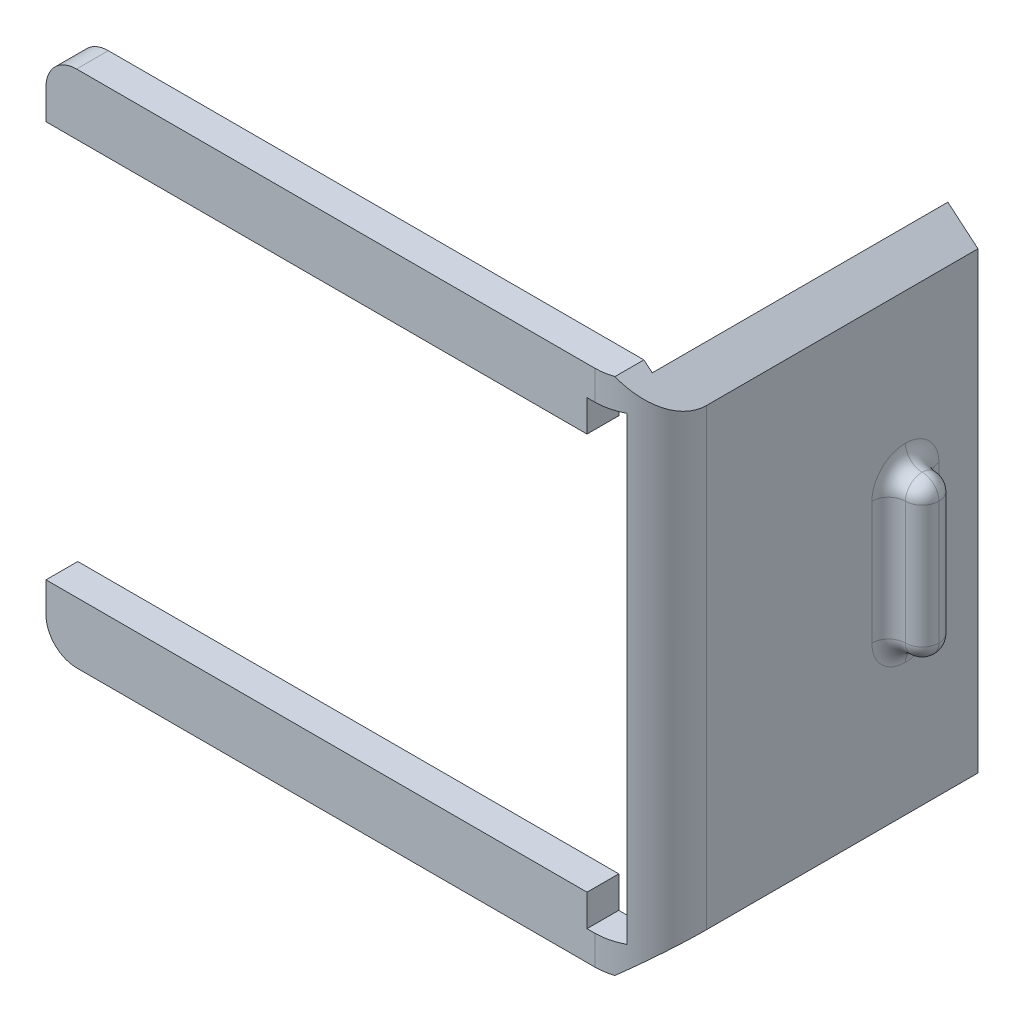
ISO-10303-21;
HEADER;
FILE_DESCRIPTION(('STEP AP214'),'2;1');
FILE_NAME('part.step','',(''),(''),'','','');
FILE_SCHEMA(('AUTOMOTIVE_DESIGN { 1 0 10303 214 1 1 1 1 }'));
ENDSEC;
DATA;
#1=APPLICATION_CONTEXT('core data for automotive mechanical design processes');
#2=APPLICATION_PROTOCOL_DEFINITION('international standard','automotive_design',2000,#1);
#3=PRODUCT_CONTEXT('',#1,'mechanical');
#4=PRODUCT('Part','Part','',(#3));
#5=PRODUCT_RELATED_PRODUCT_CATEGORY('part','',(#4));
#6=PRODUCT_DEFINITION_FORMATION('','',#4);
#7=PRODUCT_DEFINITION_CONTEXT('part definition',#1,'design');
#8=PRODUCT_DEFINITION('design','',#6,#7);
#9=PRODUCT_DEFINITION_SHAPE('','',#8);
#10=(LENGTH_UNIT() NAMED_UNIT(*) SI_UNIT(.MILLI.,.METRE.));
#11=(NAMED_UNIT(*) PLANE_ANGLE_UNIT() SI_UNIT($,.RADIAN.));
#12=(NAMED_UNIT(*) SI_UNIT($,.STERADIAN.) SOLID_ANGLE_UNIT());
#13=UNCERTAINTY_MEASURE_WITH_UNIT(LENGTH_MEASURE(1.E-05),#10,'distance_accuracy_value','');
#14=(GEOMETRIC_REPRESENTATION_CONTEXT(3) GLOBAL_UNCERTAINTY_ASSIGNED_CONTEXT((#13)) GLOBAL_UNIT_ASSIGNED_CONTEXT((#10,
#11,#12)) REPRESENTATION_CONTEXT('',''));
#15=CARTESIAN_POINT('',(0.,0.,0.));
#16=DIRECTION('',(0.,0.,1.));
#17=DIRECTION('',(1.,0.,0.));
#18=AXIS2_PLACEMENT_3D('',#15,#16,#17);
#19=CARTESIAN_POINT('',(36.6489794855664,19.0814859250043,29.3184));
#20=DIRECTION('',(-1.,0.,0.));
#21=DIRECTION('',(0.,-1.,0.));
#22=AXIS2_PLACEMENT_3D('',#19,#20,#21);
#23=PLANE('',#22);
#24=DIRECTION('',(0.,0.,-1.));
#25=VECTOR('',#24,1.);
#26=CARTESIAN_POINT('',(36.6489794855664,19.0814859250043,29.3184));
#27=LINE('',#26,#25);
#28=CARTESIAN_POINT('',(36.6489794855664,19.0814859250043,24.3184));
#29=VERTEX_POINT('',#28);
#30=CARTESIAN_POINT('',(36.6489794855664,19.0814859250043,0.));
#31=VERTEX_POINT('',#30);
#32=EDGE_CURVE('E226',#29,#31,#27,.T.);
#33=ORIENTED_EDGE('',*,*,#32,.F.);
#34=DIRECTION('',(0.,1.,0.));
#35=VECTOR('',#34,1.);
#36=CARTESIAN_POINT('',(36.6489794855664,-21.5814859250042,24.3184));
#37=LINE('',#36,#35);
#38=CARTESIAN_POINT('',(36.6489794855664,-21.5814859250042,24.3184));
#39=VERTEX_POINT('',#38);
#40=EDGE_CURVE('E202',#29,#39,#37,.F.);
#41=ORIENTED_EDGE('',*,*,#40,.T.);
#42=DIRECTION('',(0.,0.,-1.));
#43=VECTOR('',#42,1.);
#44=CARTESIAN_POINT('',(36.6489794855664,-21.5814859250042,29.3184));
#45=LINE('',#44,#43);
#46=CARTESIAN_POINT('',(36.6489794855664,-21.5814859250042,0.));
#47=VERTEX_POINT('',#46);
#48=EDGE_CURVE('E235',#39,#47,#45,.T.);
#49=ORIENTED_EDGE('',*,*,#48,.T.);
#50=DIRECTION('',(0.,1.,0.));
#51=VECTOR('',#50,1.);
#52=CARTESIAN_POINT('',(36.6489794855664,19.0814859250043,0.));
#53=LINE('',#52,#51);
#54=EDGE_CURVE('E247',#47,#31,#53,.T.);
#55=ORIENTED_EDGE('',*,*,#54,.T.);
#56=EDGE_LOOP('',(#33,#41,#49,#55));
#57=FACE_BOUND('',#56,.T.);
#58=CARTESIAN_POINT('',(36.6489794855664,4.25000000000002,6.5));
#59=DIRECTION('',(-1.,0.,0.));
#60=DIRECTION('',(0.,-1.,0.));
#61=AXIS2_PLACEMENT_3D('',#58,#59,#60);
#62=CIRCLE('',#61,3.);
#63=CARTESIAN_POINT('',(36.6489794855664,7.25000000000002,6.5));
#64=VERTEX_POINT('',#63);
#65=CARTESIAN_POINT('',(36.6489794855664,4.25000000000002,9.5));
#66=VERTEX_POINT('',#65);
#67=EDGE_CURVE('E114',#64,#66,#62,.F.);
#68=ORIENTED_EDGE('',*,*,#67,.F.);
#69=CARTESIAN_POINT('',(36.6489794855664,4.25000000000002,6.5));
#70=DIRECTION('',(-1.,0.,0.));
#71=DIRECTION('',(0.,-1.,0.));
#72=AXIS2_PLACEMENT_3D('',#69,#70,#71);
#73=CIRCLE('',#72,3.);
#74=CARTESIAN_POINT('',(36.6489794855664,4.25000000000002,3.5));
#75=VERTEX_POINT('',#74);
#76=EDGE_CURVE('E116',#75,#64,#73,.F.);
#77=ORIENTED_EDGE('',*,*,#76,.F.);
#78=DIRECTION('',(0.,1.,0.));
#79=VECTOR('',#78,1.);
#80=CARTESIAN_POINT('',(36.6489794855664,-8.24999999999997,3.5));
#81=LINE('',#80,#79);
#82=CARTESIAN_POINT('',(36.6489794855664,-6.74999999999997,3.5));
#83=VERTEX_POINT('',#82);
#84=EDGE_CURVE('E167',#75,#83,#81,.F.);
#85=ORIENTED_EDGE('',*,*,#84,.T.);
#86=CARTESIAN_POINT('',(36.6489794855664,-6.74999999999998,6.5));
#87=DIRECTION('',(-1.,0.,0.));
#88=DIRECTION('',(0.,-1.,0.));
#89=AXIS2_PLACEMENT_3D('',#86,#87,#88);
#90=CIRCLE('',#89,3.);
#91=CARTESIAN_POINT('',(36.6489794855664,-9.74999999999997,6.5));
#92=VERTEX_POINT('',#91);
#93=EDGE_CURVE('E164',#92,#83,#90,.F.);
#94=ORIENTED_EDGE('',*,*,#93,.F.);
#95=CARTESIAN_POINT('',(36.6489794855664,-6.74999999999998,6.5));
#96=DIRECTION('',(-1.,0.,0.));
#97=DIRECTION('',(0.,-1.,0.));
#98=AXIS2_PLACEMENT_3D('',#95,#96,#97);
#99=CIRCLE('',#98,3.);
#100=CARTESIAN_POINT('',(36.6489794855664,-6.74999999999998,9.5));
#101=VERTEX_POINT('',#100);
#102=EDGE_CURVE('E161',#101,#92,#99,.F.);
#103=ORIENTED_EDGE('',*,*,#102,.F.);
#104=DIRECTION('',(0.,-1.,0.));
#105=VECTOR('',#104,1.);
#106=CARTESIAN_POINT('',(36.6489794855664,5.75000000000002,9.5));
#107=LINE('',#106,#105);
#108=EDGE_CURVE('E119',#101,#66,#107,.F.);
#109=ORIENTED_EDGE('',*,*,#108,.T.);
#110=EDGE_LOOP('',(#68,#77,#85,#94,#103,#109));
#111=FACE_BOUND('',#110,.T.);
#112=ADVANCED_FACE('F41',(#57,#111),#23,.F.);
#113=CARTESIAN_POINT('',(0.,0.,29.3184));
#114=DIRECTION('',(0.,0.,1.));
#115=DIRECTION('',(1.,0.,0.));
#116=AXIS2_PLACEMENT_3D('',#113,#114,#115);
#117=PLANE('',#116);
#118=DIRECTION('',(-1.,0.,0.));
#119=VECTOR('',#118,1.);
#120=CARTESIAN_POINT('',(33.2005045161091,-24.4751,29.3184));
#121=LINE('',#120,#119);
#122=CARTESIAN_POINT('',(31.6489794855664,-24.4751,29.3184));
#123=VERTEX_POINT('',#122);
#124=CARTESIAN_POINT('',(-14.764,-24.4751,29.3184));
#125=VERTEX_POINT('',#124);
#126=EDGE_CURVE('E331',#123,#125,#121,.T.);
#127=ORIENTED_EDGE('',*,*,#126,.F.);
#128=DIRECTION('',(0.,1.,0.));
#129=VECTOR('',#128,1.);
#130=CARTESIAN_POINT('',(31.6489794855664,19.0814859250043,29.3184));
#131=LINE('',#130,#129);
#132=CARTESIAN_POINT('',(31.6489794855664,-21.8461986158981,29.3184));
#133=VERTEX_POINT('',#132);
#134=EDGE_CURVE('E220',#123,#133,#131,.T.);
#135=ORIENTED_EDGE('',*,*,#134,.T.);
#136=DIRECTION('',(1.,0.,0.));
#137=VECTOR('',#136,1.);
#138=CARTESIAN_POINT('',(30.95,-21.8461986158981,29.3184));
#139=LINE('',#138,#137);
#140=CARTESIAN_POINT('',(30.95,-21.8461986158981,29.3184));
#141=VERTEX_POINT('',#140);
#142=EDGE_CURVE('E335',#141,#133,#139,.T.);
#143=ORIENTED_EDGE('',*,*,#142,.F.);
#144=DIRECTION('',(0.,-1.,0.));
#145=VECTOR('',#144,1.);
#146=CARTESIAN_POINT('',(30.95,-19.0141,29.3184));
#147=LINE('',#146,#145);
#148=CARTESIAN_POINT('',(30.95,-19.0141,29.3184));
#149=VERTEX_POINT('',#148);
#150=EDGE_CURVE('E314',#149,#141,#147,.T.);
#151=ORIENTED_EDGE('',*,*,#150,.F.);
#152=DIRECTION('',(1.,0.,0.));
#153=VECTOR('',#152,1.);
#154=CARTESIAN_POINT('',(-17.5037090572133,-19.0141,29.3184));
#155=LINE('',#154,#153);
#156=CARTESIAN_POINT('',(-17.5037090572133,-19.0141,29.3184));
#157=VERTEX_POINT('',#156);
#158=EDGE_CURVE('E319',#157,#149,#155,.T.);
#159=ORIENTED_EDGE('',*,*,#158,.F.);
#160=DIRECTION('',(0.,1.,0.));
#161=VECTOR('',#160,1.);
#162=CARTESIAN_POINT('',(-17.5037090572133,-21.7351,29.3184));
#163=LINE('',#162,#161);
#164=CARTESIAN_POINT('',(-17.5037090572133,-21.7351,29.3184));
#165=VERTEX_POINT('',#164);
#166=EDGE_CURVE('E323',#165,#157,#163,.T.);
#167=ORIENTED_EDGE('',*,*,#166,.F.);
#168=CARTESIAN_POINT('',(-14.764,-21.73539092734,29.3184));
#169=DIRECTION('',(0.,0.,-1.));
#170=DIRECTION('',(-1.,0.,0.));
#171=AXIS2_PLACEMENT_3D('',#168,#169,#170);
#172=CIRCLE('',#171,2.73970907265998);
#173=EDGE_CURVE('E327',#125,#165,#172,.T.);
#174=ORIENTED_EDGE('',*,*,#173,.F.);
#175=EDGE_LOOP('',(#127,#135,#143,#151,#159,#167,#174));
#176=FACE_BOUND('',#175,.T.);
#177=ADVANCED_FACE('F391',(#176),#117,.T.);
#178=CARTESIAN_POINT('',(33.95,21.3461986158981,29.3184));
#179=DIRECTION('',(1.,0.,0.));
#180=DIRECTION('',(0.,1.,0.));
#181=AXIS2_PLACEMENT_3D('',#178,#179,#180);
#182=PLANE('',#181);
#183=DIRECTION('',(0.,0.,1.));
#184=VECTOR('',#183,1.);
#185=CARTESIAN_POINT('',(33.95,-21.8461986158981,-25.2690970531488));
#186=LINE('',#185,#184);
#187=CARTESIAN_POINT('',(33.95,-21.8461986158981,26.4736));
#188=VERTEX_POINT('',#187);
#189=CARTESIAN_POINT('',(33.95,-21.8461986158981,28.7574657341557));
#190=VERTEX_POINT('',#189);
#191=EDGE_CURVE('E337',#188,#190,#186,.T.);
#192=ORIENTED_EDGE('',*,*,#191,.T.);
#193=DIRECTION('',(0.,-1.,0.));
#194=VECTOR('',#193,1.);
#195=CARTESIAN_POINT('',(33.95,-21.8461986158981,28.7574657341557));
#196=LINE('',#195,#194);
#197=CARTESIAN_POINT('',(33.95,19.3461986158981,28.7574657341557));
#198=VERTEX_POINT('',#197);
#199=EDGE_CURVE('E214',#190,#198,#196,.F.);
#200=ORIENTED_EDGE('',*,*,#199,.T.);
#201=DIRECTION('',(0.,0.,1.));
#202=VECTOR('',#201,1.);
#203=CARTESIAN_POINT('',(33.95,19.3461986158981,-25.2690970531488));
#204=LINE('',#203,#202);
#205=CARTESIAN_POINT('',(33.95,19.3461986158981,26.4736));
#206=VERTEX_POINT('',#205);
#207=EDGE_CURVE('E254',#206,#198,#204,.T.);
#208=ORIENTED_EDGE('',*,*,#207,.F.);
#209=DIRECTION('',(0.,1.,0.));
#210=VECTOR('',#209,1.);
#211=CARTESIAN_POINT('',(33.95,19.3461986158981,26.4736));
#212=LINE('',#211,#210);
#213=CARTESIAN_POINT('',(33.95,21.3461986158981,26.4736));
#214=VERTEX_POINT('',#213);
#215=EDGE_CURVE('E257',#206,#214,#212,.T.);
#216=ORIENTED_EDGE('',*,*,#215,.T.);
#217=DIRECTION('',(0.,0.,-1.));
#218=VECTOR('',#217,1.);
#219=CARTESIAN_POINT('',(33.95,21.3461986158981,29.3184));
#220=LINE('',#219,#218);
#221=CARTESIAN_POINT('',(33.95,21.3461986158981,0.));
#222=VERTEX_POINT('',#221);
#223=EDGE_CURVE('E229',#214,#222,#220,.T.);
#224=ORIENTED_EDGE('',*,*,#223,.T.);
#225=DIRECTION('',(0.,-1.,0.));
#226=VECTOR('',#225,1.);
#227=CARTESIAN_POINT('',(33.95,21.3461986158981,0.));
#228=LINE('',#227,#226);
#229=CARTESIAN_POINT('',(33.95,-23.8461986158981,0.));
#230=VERTEX_POINT('',#229);
#231=EDGE_CURVE('E241',#222,#230,#228,.T.);
#232=ORIENTED_EDGE('',*,*,#231,.T.);
#233=DIRECTION('',(0.,0.,-1.));
#234=VECTOR('',#233,1.);
#235=CARTESIAN_POINT('',(33.95,-23.8461986158981,29.3184));
#236=LINE('',#235,#234);
#237=CARTESIAN_POINT('',(33.95,-23.8461986158981,26.4736));
#238=VERTEX_POINT('',#237);
#239=EDGE_CURVE('E232',#238,#230,#236,.T.);
#240=ORIENTED_EDGE('',*,*,#239,.F.);
#241=DIRECTION('',(0.,-1.,0.));
#242=VECTOR('',#241,1.);
#243=CARTESIAN_POINT('',(33.95,-21.8461986158981,26.4736));
#244=LINE('',#243,#242);
#245=EDGE_CURVE('E350',#188,#238,#244,.T.);
#246=ORIENTED_EDGE('',*,*,#245,.F.);
#247=EDGE_LOOP('',(#192,#200,#208,#216,#224,#232,#240,#246));
#248=FACE_BOUND('',#247,.T.);
#249=ADVANCED_FACE('F511',(#248),#182,.F.);
#250=CARTESIAN_POINT('',(36.6489794855664,19.0814859250043,29.3184));
#251=DIRECTION('',(-0.642787609686545,-0.766044443118973,0.));
#252=DIRECTION('',(0.766044443118973,-0.642787609686545,0.));
#253=AXIS2_PLACEMENT_3D('',#250,#251,#252);
#254=PLANE('',#253);
#255=DIRECTION('',(0.,0.,1.));
#256=VECTOR('',#255,1.);
#257=CARTESIAN_POINT('',(33.2005045161091,21.9751000000001,-25.2690970531488));
#258=LINE('',#257,#256);
#259=CARTESIAN_POINT('',(33.2005045161091,21.9751000000001,26.4736));
#260=VERTEX_POINT('',#259);
#261=CARTESIAN_POINT('',(33.2005045161091,21.9751000000001,29.0715852561834));
#262=VERTEX_POINT('',#261);
#263=EDGE_CURVE('E259',#260,#262,#258,.T.);
#264=ORIENTED_EDGE('',*,*,#263,.T.);
#265=CARTESIAN_POINT('',(31.6489794855664,23.2769840808908,24.3184));
#266=DIRECTION('',(-0.642787609686545,-0.766044443118973,0.));
#267=DIRECTION('',(0.766044443118973,-0.642787609686545,0.));
#268=AXIS2_PLACEMENT_3D('',#265,#266,#267);
#269=ELLIPSE('',#268,6.52703644666143,5.);
#270=EDGE_CURVE('E205',#262,#29,#269,.F.);
#271=ORIENTED_EDGE('',*,*,#270,.T.);
#272=ORIENTED_EDGE('',*,*,#32,.T.);
#273=DIRECTION('',(-0.766044443118973,0.642787609686545,0.));
#274=VECTOR('',#273,1.);
#275=CARTESIAN_POINT('',(36.6489794855664,19.0814859250043,0.));
#276=LINE('',#275,#274);
#277=EDGE_CURVE('E244',#31,#222,#276,.T.);
#278=ORIENTED_EDGE('',*,*,#277,.T.);
#279=ORIENTED_EDGE('',*,*,#223,.F.);
#280=DIRECTION('',(-0.76604444311897,0.642787609686549,0.));
#281=VECTOR('',#280,1.);
#282=CARTESIAN_POINT('',(33.95,21.3461986158981,26.4736));
#283=LINE('',#282,#281);
#284=EDGE_CURVE('E263',#214,#260,#283,.T.);
#285=ORIENTED_EDGE('',*,*,#284,.T.);
#286=EDGE_LOOP('',(#264,#271,#272,#278,#279,#285));
#287=FACE_BOUND('',#286,.T.);
#288=ADVANCED_FACE('F506',(#287),#254,.F.);
#289=CARTESIAN_POINT('',(36.6489794855664,-21.5814859250042,29.3184));
#290=DIRECTION('',(-0.642787609686547,0.766044443118971,0.));
#291=DIRECTION('',(-0.766044443118971,-0.642787609686547,0.));
#292=AXIS2_PLACEMENT_3D('',#289,#290,#291);
#293=PLANE('',#292);
#294=ORIENTED_EDGE('',*,*,#48,.F.);
#295=CARTESIAN_POINT('',(31.6489794855664,-25.7769840808907,24.3184));
#296=DIRECTION('',(-0.642787609686547,0.766044443118971,0.));
#297=DIRECTION('',(-0.766044443118971,-0.642787609686547,0.));
#298=AXIS2_PLACEMENT_3D('',#295,#296,#297);
#299=ELLIPSE('',#298,6.52703644666145,5.);
#300=CARTESIAN_POINT('',(33.2005045161091,-24.4751,29.0715852561834));
#301=VERTEX_POINT('',#300);
#302=EDGE_CURVE('E197',#39,#301,#299,.F.);
#303=ORIENTED_EDGE('',*,*,#302,.T.);
#304=DIRECTION('',(0.,0.,1.));
#305=VECTOR('',#304,1.);
#306=CARTESIAN_POINT('',(33.2005045161091,-24.4751,-25.2690970531488));
#307=LINE('',#306,#305);
#308=CARTESIAN_POINT('',(33.2005045161091,-24.4751,26.4736));
#309=VERTEX_POINT('',#308);
#310=EDGE_CURVE('E334',#309,#301,#307,.T.);
#311=ORIENTED_EDGE('',*,*,#310,.F.);
#312=DIRECTION('',(-0.766044443118984,-0.642787609686532,0.));
#313=VECTOR('',#312,1.);
#314=CARTESIAN_POINT('',(33.95,-23.8461986158981,26.4736));
#315=LINE('',#314,#313);
#316=EDGE_CURVE('E347',#238,#309,#315,.T.);
#317=ORIENTED_EDGE('',*,*,#316,.F.);
#318=ORIENTED_EDGE('',*,*,#239,.T.);
#319=DIRECTION('',(0.766044443118971,0.642787609686547,0.));
#320=VECTOR('',#319,1.);
#321=CARTESIAN_POINT('',(36.6489794855664,-21.5814859250042,0.));
#322=LINE('',#321,#320);
#323=EDGE_CURVE('E238',#230,#47,#322,.T.);
#324=ORIENTED_EDGE('',*,*,#323,.T.);
#325=EDGE_LOOP('',(#294,#303,#311,#317,#318,#324));
#326=FACE_BOUND('',#325,.T.);
#327=ADVANCED_FACE('F421',(#326),#293,.F.);
#328=DIRECTION('',(1.,0.,0.));
#329=VECTOR('',#328,1.);
#330=CARTESIAN_POINT('',(30.95,19.3461986158981,29.3184));
#331=LINE('',#330,#329);
#332=CARTESIAN_POINT('',(30.95,19.3461986158981,29.3184));
#333=VERTEX_POINT('',#332);
#334=CARTESIAN_POINT('',(31.6489794855664,19.3461986158981,29.3184));
#335=VERTEX_POINT('',#334);
#336=EDGE_CURVE('E299',#333,#335,#331,.T.);
#337=ORIENTED_EDGE('',*,*,#336,.T.);
#338=DIRECTION('',(0.,1.,0.));
#339=VECTOR('',#338,1.);
#340=CARTESIAN_POINT('',(31.6489794855664,19.0814859250043,29.3184));
#341=LINE('',#340,#339);
#342=CARTESIAN_POINT('',(31.6489794855664,21.9751000000001,29.3184));
#343=VERTEX_POINT('',#342);
#344=EDGE_CURVE('E223',#335,#343,#341,.T.);
#345=ORIENTED_EDGE('',*,*,#344,.T.);
#346=DIRECTION('',(-1.,0.,0.));
#347=VECTOR('',#346,1.);
#348=CARTESIAN_POINT('',(33.2005045161091,21.9751000000001,29.3184));
#349=LINE('',#348,#347);
#350=CARTESIAN_POINT('',(-14.764,21.9751,29.3184));
#351=VERTEX_POINT('',#350);
#352=EDGE_CURVE('E303',#343,#351,#349,.T.);
#353=ORIENTED_EDGE('',*,*,#352,.T.);
#354=CARTESIAN_POINT('',(-14.764,19.2353909273401,29.3184));
#355=DIRECTION('',(0.,0.,1.));
#356=DIRECTION('',(1.,0.,0.));
#357=AXIS2_PLACEMENT_3D('',#354,#355,#356);
#358=CIRCLE('',#357,2.73970907265998);
#359=CARTESIAN_POINT('',(-17.5037090572133,19.2351,29.3184));
#360=VERTEX_POINT('',#359);
#361=EDGE_CURVE('E306',#351,#360,#358,.T.);
#362=ORIENTED_EDGE('',*,*,#361,.T.);
#363=DIRECTION('',(0.,-1.,0.));
#364=VECTOR('',#363,1.);
#365=CARTESIAN_POINT('',(-17.5037090572133,19.2351,29.3184));
#366=LINE('',#365,#364);
#367=CARTESIAN_POINT('',(-17.5037090572133,16.5141,29.3184));
#368=VERTEX_POINT('',#367);
#369=EDGE_CURVE('E309',#360,#368,#366,.T.);
#370=ORIENTED_EDGE('',*,*,#369,.T.);
#371=DIRECTION('',(1.,0.,0.));
#372=VECTOR('',#371,1.);
#373=CARTESIAN_POINT('',(-17.5037090572133,16.5141,29.3184));
#374=LINE('',#373,#372);
#375=CARTESIAN_POINT('',(30.95,16.5141,29.3184));
#376=VERTEX_POINT('',#375);
#377=EDGE_CURVE('E295',#368,#376,#374,.T.);
#378=ORIENTED_EDGE('',*,*,#377,.T.);
#379=DIRECTION('',(0.,1.,0.));
#380=VECTOR('',#379,1.);
#381=CARTESIAN_POINT('',(30.95,16.5141,29.3184));
#382=LINE('',#381,#380);
#383=EDGE_CURVE('E296',#376,#333,#382,.T.);
#384=ORIENTED_EDGE('',*,*,#383,.T.);
#385=EDGE_LOOP('',(#337,#345,#353,#362,#370,#378,#384));
#386=FACE_BOUND('',#385,.T.);
#387=ADVANCED_FACE('F497',(#386),#117,.T.);
#388=CARTESIAN_POINT('',(0.,0.,0.));
#389=DIRECTION('',(0.,0.,1.));
#390=DIRECTION('',(1.,0.,0.));
#391=AXIS2_PLACEMENT_3D('',#388,#389,#390);
#392=PLANE('',#391);
#393=ORIENTED_EDGE('',*,*,#54,.F.);
#394=ORIENTED_EDGE('',*,*,#323,.F.);
#395=ORIENTED_EDGE('',*,*,#231,.F.);
#396=ORIENTED_EDGE('',*,*,#277,.F.);
#397=EDGE_LOOP('',(#393,#394,#395,#396));
#398=FACE_BOUND('',#397,.T.);
#399=ADVANCED_FACE('F709',(#398),#392,.F.);
#400=CARTESIAN_POINT('',(8.22299999999999,-1.24999999999999,26.4736));
#401=DIRECTION('',(0.,0.,-1.));
#402=DIRECTION('',(1.,0.,0.));
#403=AXIS2_PLACEMENT_3D('',#400,#401,#402);
#404=PLANE('',#403);
#405=DIRECTION('',(0.,1.,0.));
#406=VECTOR('',#405,1.);
#407=CARTESIAN_POINT('',(30.95,16.5141,26.4736));
#408=LINE('',#407,#406);
#409=CARTESIAN_POINT('',(30.95,16.5141,26.4736));
#410=VERTEX_POINT('',#409);
#411=CARTESIAN_POINT('',(30.95,19.3461986158981,26.4736));
#412=VERTEX_POINT('',#411);
#413=EDGE_CURVE('E253',#410,#412,#408,.T.);
#414=ORIENTED_EDGE('',*,*,#413,.F.);
#415=DIRECTION('',(1.,0.,0.));
#416=VECTOR('',#415,1.);
#417=CARTESIAN_POINT('',(-17.5037090572133,16.5141,26.4736));
#418=LINE('',#417,#416);
#419=CARTESIAN_POINT('',(-17.5037090572133,16.5141,26.4736));
#420=VERTEX_POINT('',#419);
#421=EDGE_CURVE('E275',#420,#410,#418,.T.);
#422=ORIENTED_EDGE('',*,*,#421,.F.);
#423=DIRECTION('',(0.,-1.,0.));
#424=VECTOR('',#423,1.);
#425=CARTESIAN_POINT('',(-17.5037090572133,19.2351,26.4736));
#426=LINE('',#425,#424);
#427=CARTESIAN_POINT('',(-17.5037090572133,19.2351,26.4736));
#428=VERTEX_POINT('',#427);
#429=EDGE_CURVE('E271',#428,#420,#426,.T.);
#430=ORIENTED_EDGE('',*,*,#429,.F.);
#431=CARTESIAN_POINT('',(-14.764,19.2353909273401,26.4736));
#432=DIRECTION('',(0.,0.,-1.));
#433=DIRECTION('',(0.,1.,0.));
#434=AXIS2_PLACEMENT_3D('',#431,#432,#433);
#435=CIRCLE('',#434,2.73970907265998);
#436=CARTESIAN_POINT('',(-14.764,21.9751,26.4736));
#437=VERTEX_POINT('',#436);
#438=EDGE_CURVE('E267',#437,#428,#435,.F.);
#439=ORIENTED_EDGE('',*,*,#438,.F.);
#440=DIRECTION('',(-1.,0.,0.));
#441=VECTOR('',#440,1.);
#442=CARTESIAN_POINT('',(33.2005045161091,21.9751000000001,26.4736));
#443=LINE('',#442,#441);
#444=EDGE_CURVE('E262',#260,#437,#443,.T.);
#445=ORIENTED_EDGE('',*,*,#444,.F.);
#446=ORIENTED_EDGE('',*,*,#284,.F.);
#447=ORIENTED_EDGE('',*,*,#215,.F.);
#448=DIRECTION('',(1.,0.,0.));
#449=VECTOR('',#448,1.);
#450=CARTESIAN_POINT('',(30.95,19.3461986158981,26.4736));
#451=LINE('',#450,#449);
#452=EDGE_CURVE('E258',#412,#206,#451,.T.);
#453=ORIENTED_EDGE('',*,*,#452,.F.);
#454=EDGE_LOOP('',(#414,#422,#430,#439,#445,#446,#447,#453));
#455=FACE_BOUND('',#454,.T.);
#456=ADVANCED_FACE('F509',(#455),#404,.T.);
#457=CARTESIAN_POINT('',(30.95,19.3461986158981,-25.2690970531488));
#458=DIRECTION('',(0.,-1.,0.));
#459=DIRECTION('',(0.,0.,-1.));
#460=AXIS2_PLACEMENT_3D('',#457,#458,#459);
#461=PLANE('',#460);
#462=ORIENTED_EDGE('',*,*,#207,.T.);
#463=CARTESIAN_POINT('',(31.6489794855664,19.3461986158981,24.3184));
#464=DIRECTION('',(0.,-1.,0.));
#465=DIRECTION('',(0.,0.,-1.));
#466=AXIS2_PLACEMENT_3D('',#463,#464,#465);
#467=CIRCLE('',#466,5.);
#468=EDGE_CURVE('E211',#198,#335,#467,.T.);
#469=ORIENTED_EDGE('',*,*,#468,.T.);
#470=ORIENTED_EDGE('',*,*,#336,.F.);
#471=DIRECTION('',(0.,0.,1.));
#472=VECTOR('',#471,1.);
#473=CARTESIAN_POINT('',(30.95,19.3461986158981,-25.2690970531488));
#474=LINE('',#473,#472);
#475=EDGE_CURVE('E250',#412,#333,#474,.T.);
#476=ORIENTED_EDGE('',*,*,#475,.F.);
#477=ORIENTED_EDGE('',*,*,#452,.T.);
#478=EDGE_LOOP('',(#462,#469,#470,#476,#477));
#479=FACE_BOUND('',#478,.T.);
#480=ADVANCED_FACE('F492',(#479),#461,.T.);
#481=CARTESIAN_POINT('',(33.2005045161091,21.9751000000001,-25.2690970531488));
#482=DIRECTION('',(0.,1.,0.));
#483=DIRECTION('',(-1.,0.,0.));
#484=AXIS2_PLACEMENT_3D('',#481,#482,#483);
#485=PLANE('',#484);
#486=ORIENTED_EDGE('',*,*,#352,.F.);
#487=CARTESIAN_POINT('',(31.6489794855664,21.9751000000001,24.3184));
#488=DIRECTION('',(0.,1.,0.));
#489=DIRECTION('',(-1.,0.,0.));
#490=AXIS2_PLACEMENT_3D('',#487,#488,#489);
#491=CIRCLE('',#490,5.);
#492=EDGE_CURVE('E208',#343,#262,#491,.T.);
#493=ORIENTED_EDGE('',*,*,#492,.T.);
#494=ORIENTED_EDGE('',*,*,#263,.F.);
#495=ORIENTED_EDGE('',*,*,#444,.T.);
#496=DIRECTION('',(0.,0.,1.));
#497=VECTOR('',#496,1.);
#498=CARTESIAN_POINT('',(-14.764,21.9751,-25.2690970531488));
#499=LINE('',#498,#497);
#500=EDGE_CURVE('E264',#437,#351,#499,.T.);
#501=ORIENTED_EDGE('',*,*,#500,.T.);
#502=EDGE_LOOP('',(#486,#493,#494,#495,#501));
#503=FACE_BOUND('',#502,.T.);
#504=ADVANCED_FACE('F504',(#503),#485,.T.);
#505=CARTESIAN_POINT('',(-14.764,19.2353909273401,-25.2690970531488));
#506=DIRECTION('',(0.,0.,1.));
#507=DIRECTION('',(1.,0.,0.));
#508=AXIS2_PLACEMENT_3D('',#505,#506,#507);
#509=CYLINDRICAL_SURFACE('',#508,2.73970907265998);
#510=ORIENTED_EDGE('',*,*,#500,.F.);
#511=ORIENTED_EDGE('',*,*,#438,.T.);
#512=DIRECTION('',(0.,0.,1.));
#513=VECTOR('',#512,1.);
#514=CARTESIAN_POINT('',(-17.5037090572133,19.2351,-25.2690970531488));
#515=LINE('',#514,#513);
#516=EDGE_CURVE('E268',#428,#360,#515,.T.);
#517=ORIENTED_EDGE('',*,*,#516,.T.);
#518=ORIENTED_EDGE('',*,*,#361,.F.);
#519=EDGE_LOOP('',(#510,#511,#517,#518));
#520=FACE_BOUND('',#519,.T.);
#521=ADVANCED_FACE('F678',(#520),#509,.T.);
#522=CARTESIAN_POINT('',(-17.5037090572133,19.2351,-25.2690970531488));
#523=DIRECTION('',(-1.,0.,0.));
#524=DIRECTION('',(0.,0.,1.));
#525=AXIS2_PLACEMENT_3D('',#522,#523,#524);
#526=PLANE('',#525);
#527=ORIENTED_EDGE('',*,*,#516,.F.);
#528=ORIENTED_EDGE('',*,*,#429,.T.);
#529=DIRECTION('',(0.,0.,1.));
#530=VECTOR('',#529,1.);
#531=CARTESIAN_POINT('',(-17.5037090572133,16.5141,-25.2690970531488));
#532=LINE('',#531,#530);
#533=EDGE_CURVE('E272',#420,#368,#532,.T.);
#534=ORIENTED_EDGE('',*,*,#533,.T.);
#535=ORIENTED_EDGE('',*,*,#369,.F.);
#536=EDGE_LOOP('',(#527,#528,#534,#535));
#537=FACE_BOUND('',#536,.T.);
#538=ADVANCED_FACE('F669',(#537),#526,.T.);
#539=CARTESIAN_POINT('',(-17.5037090572133,16.5141,-25.2690970531488));
#540=DIRECTION('',(0.,-1.,0.));
#541=DIRECTION('',(1.,0.,0.));
#542=AXIS2_PLACEMENT_3D('',#539,#540,#541);
#543=PLANE('',#542);
#544=ORIENTED_EDGE('',*,*,#533,.F.);
#545=ORIENTED_EDGE('',*,*,#421,.T.);
#546=DIRECTION('',(0.,0.,1.));
#547=VECTOR('',#546,1.);
#548=CARTESIAN_POINT('',(30.95,16.5141,-25.2690970531488));
#549=LINE('',#548,#547);
#550=EDGE_CURVE('E276',#410,#376,#549,.T.);
#551=ORIENTED_EDGE('',*,*,#550,.T.);
#552=ORIENTED_EDGE('',*,*,#377,.F.);
#553=EDGE_LOOP('',(#544,#545,#551,#552));
#554=FACE_BOUND('',#553,.T.);
#555=ADVANCED_FACE('F660',(#554),#543,.T.);
#556=CARTESIAN_POINT('',(30.95,16.5141,-25.2690970531488));
#557=DIRECTION('',(1.,0.,0.));
#558=DIRECTION('',(0.,0.,-1.));
#559=AXIS2_PLACEMENT_3D('',#556,#557,#558);
#560=PLANE('',#559);
#561=ORIENTED_EDGE('',*,*,#550,.F.);
#562=ORIENTED_EDGE('',*,*,#413,.T.);
#563=ORIENTED_EDGE('',*,*,#475,.T.);
#564=ORIENTED_EDGE('',*,*,#383,.F.);
#565=EDGE_LOOP('',(#561,#562,#563,#564));
#566=FACE_BOUND('',#565,.T.);
#567=ADVANCED_FACE('F653',(#566),#560,.T.);
#568=CARTESIAN_POINT('',(30.95,-21.8461986158981,-25.2690970531488));
#569=DIRECTION('',(0.,-1.,0.));
#570=DIRECTION('',(0.,0.,-1.));
#571=AXIS2_PLACEMENT_3D('',#568,#569,#570);
#572=PLANE('',#571);
#573=ORIENTED_EDGE('',*,*,#142,.T.);
#574=CARTESIAN_POINT('',(31.6489794855664,-21.8461986158981,24.3184));
#575=DIRECTION('',(0.,-1.,0.));
#576=DIRECTION('',(0.,0.,-1.));
#577=AXIS2_PLACEMENT_3D('',#574,#575,#576);
#578=CIRCLE('',#577,5.);
#579=EDGE_CURVE('E217',#133,#190,#578,.F.);
#580=ORIENTED_EDGE('',*,*,#579,.T.);
#581=ORIENTED_EDGE('',*,*,#191,.F.);
#582=DIRECTION('',(1.,0.,0.));
#583=VECTOR('',#582,1.);
#584=CARTESIAN_POINT('',(30.95,-21.8461986158981,26.4736));
#585=LINE('',#584,#583);
#586=CARTESIAN_POINT('',(30.95,-21.8461986158981,26.4736));
#587=VERTEX_POINT('',#586);
#588=EDGE_CURVE('E353',#587,#188,#585,.T.);
#589=ORIENTED_EDGE('',*,*,#588,.F.);
#590=DIRECTION('',(0.,0.,1.));
#591=VECTOR('',#590,1.);
#592=CARTESIAN_POINT('',(30.95,-21.8461986158981,-25.2690970531488));
#593=LINE('',#592,#591);
#594=EDGE_CURVE('E300',#587,#141,#593,.T.);
#595=ORIENTED_EDGE('',*,*,#594,.T.);
#596=EDGE_LOOP('',(#573,#580,#581,#589,#595));
#597=FACE_BOUND('',#596,.T.);
#598=ADVANCED_FACE('F375',(#597),#572,.F.);
#599=CARTESIAN_POINT('',(33.2005045161091,-24.4751,-25.2690970531488));
#600=DIRECTION('',(0.,1.,0.));
#601=DIRECTION('',(0.,0.,1.));
#602=AXIS2_PLACEMENT_3D('',#599,#600,#601);
#603=PLANE('',#602);
#604=ORIENTED_EDGE('',*,*,#310,.T.);
#605=CARTESIAN_POINT('',(31.6489794855664,-24.4751,24.3184));
#606=DIRECTION('',(0.,1.,0.));
#607=DIRECTION('',(0.,0.,1.));
#608=AXIS2_PLACEMENT_3D('',#605,#606,#607);
#609=CIRCLE('',#608,5.);
#610=EDGE_CURVE('E193',#301,#123,#609,.F.);
#611=ORIENTED_EDGE('',*,*,#610,.T.);
#612=ORIENTED_EDGE('',*,*,#126,.T.);
#613=DIRECTION('',(0.,0.,1.));
#614=VECTOR('',#613,1.);
#615=CARTESIAN_POINT('',(-14.764,-24.4751,-25.2690970531488));
#616=LINE('',#615,#614);
#617=CARTESIAN_POINT('',(-14.764,-24.4751,26.4736));
#618=VERTEX_POINT('',#617);
#619=EDGE_CURVE('E330',#618,#125,#616,.T.);
#620=ORIENTED_EDGE('',*,*,#619,.F.);
#621=DIRECTION('',(-1.,0.,0.));
#622=VECTOR('',#621,1.);
#623=CARTESIAN_POINT('',(33.2005045161091,-24.4751,26.4736));
#624=LINE('',#623,#622);
#625=EDGE_CURVE('E344',#309,#618,#624,.T.);
#626=ORIENTED_EDGE('',*,*,#625,.F.);
#627=EDGE_LOOP('',(#604,#611,#612,#620,#626));
#628=FACE_BOUND('',#627,.T.);
#629=ADVANCED_FACE('F425',(#628),#603,.F.);
#630=CARTESIAN_POINT('',(-14.764,-21.73539092734,-25.2690970531488));
#631=DIRECTION('',(0.,0.,1.));
#632=DIRECTION('',(1.,0.,0.));
#633=AXIS2_PLACEMENT_3D('',#630,#631,#632);
#634=CYLINDRICAL_SURFACE('',#633,2.73970907265998);
#635=CARTESIAN_POINT('',(-14.764,-21.73539092734,26.4736));
#636=DIRECTION('',(0.,0.,-1.));
#637=DIRECTION('',(0.,1.,0.));
#638=AXIS2_PLACEMENT_3D('',#635,#636,#637);
#639=CIRCLE('',#638,2.73970907265998);
#640=CARTESIAN_POINT('',(-17.5037090572133,-21.7351,26.4736));
#641=VERTEX_POINT('',#640);
#642=EDGE_CURVE('E341',#618,#641,#639,.T.);
#643=ORIENTED_EDGE('',*,*,#642,.F.);
#644=ORIENTED_EDGE('',*,*,#619,.T.);
#645=ORIENTED_EDGE('',*,*,#173,.T.);
#646=DIRECTION('',(0.,0.,1.));
#647=VECTOR('',#646,1.);
#648=CARTESIAN_POINT('',(-17.5037090572133,-21.7351,-25.2690970531488));
#649=LINE('',#648,#647);
#650=EDGE_CURVE('E326',#641,#165,#649,.T.);
#651=ORIENTED_EDGE('',*,*,#650,.F.);
#652=EDGE_LOOP('',(#643,#644,#645,#651));
#653=FACE_BOUND('',#652,.T.);
#654=ADVANCED_FACE('F528',(#653),#634,.T.);
#655=CARTESIAN_POINT('',(-17.5037090572133,-21.7351,-25.2690970531488));
#656=DIRECTION('',(1.,0.,0.));
#657=DIRECTION('',(0.,0.,-1.));
#658=AXIS2_PLACEMENT_3D('',#655,#656,#657);
#659=PLANE('',#658);
#660=DIRECTION('',(0.,1.,0.));
#661=VECTOR('',#660,1.);
#662=CARTESIAN_POINT('',(-17.5037090572133,-21.7351,26.4736));
#663=LINE('',#662,#661);
#664=CARTESIAN_POINT('',(-17.5037090572133,-19.0141,26.4736));
#665=VERTEX_POINT('',#664);
#666=EDGE_CURVE('E155',#641,#665,#663,.T.);
#667=ORIENTED_EDGE('',*,*,#666,.F.);
#668=ORIENTED_EDGE('',*,*,#650,.T.);
#669=ORIENTED_EDGE('',*,*,#166,.T.);
#670=DIRECTION('',(0.,0.,1.));
#671=VECTOR('',#670,1.);
#672=CARTESIAN_POINT('',(-17.5037090572133,-19.0141,-25.2690970531488));
#673=LINE('',#672,#671);
#674=EDGE_CURVE('E322',#665,#157,#673,.T.);
#675=ORIENTED_EDGE('',*,*,#674,.F.);
#676=EDGE_LOOP('',(#667,#668,#669,#675));
#677=FACE_BOUND('',#676,.T.);
#678=ADVANCED_FACE('F526',(#677),#659,.F.);
#679=CARTESIAN_POINT('',(-17.5037090572133,-19.0141,-25.2690970531488));
#680=DIRECTION('',(0.,-1.,0.));
#681=DIRECTION('',(0.,0.,-1.));
#682=AXIS2_PLACEMENT_3D('',#679,#680,#681);
#683=PLANE('',#682);
#684=DIRECTION('',(1.,0.,0.));
#685=VECTOR('',#684,1.);
#686=CARTESIAN_POINT('',(-17.5037090572133,-19.0141,26.4736));
#687=LINE('',#686,#685);
#688=CARTESIAN_POINT('',(30.95,-19.0141,26.4736));
#689=VERTEX_POINT('',#688);
#690=EDGE_CURVE('E151',#665,#689,#687,.T.);
#691=ORIENTED_EDGE('',*,*,#690,.F.);
#692=ORIENTED_EDGE('',*,*,#674,.T.);
#693=ORIENTED_EDGE('',*,*,#158,.T.);
#694=DIRECTION('',(0.,0.,1.));
#695=VECTOR('',#694,1.);
#696=CARTESIAN_POINT('',(30.95,-19.0141,-25.2690970531488));
#697=LINE('',#696,#695);
#698=EDGE_CURVE('E317',#689,#149,#697,.T.);
#699=ORIENTED_EDGE('',*,*,#698,.F.);
#700=EDGE_LOOP('',(#691,#692,#693,#699));
#701=FACE_BOUND('',#700,.T.);
#702=ADVANCED_FACE('F523',(#701),#683,.F.);
#703=CARTESIAN_POINT('',(30.95,-19.0141,-25.2690970531488));
#704=DIRECTION('',(-1.,0.,0.));
#705=DIRECTION('',(0.,0.,1.));
#706=AXIS2_PLACEMENT_3D('',#703,#704,#705);
#707=PLANE('',#706);
#708=DIRECTION('',(0.,-1.,0.));
#709=VECTOR('',#708,1.);
#710=CARTESIAN_POINT('',(30.95,-19.0141,26.4736));
#711=LINE('',#710,#709);
#712=EDGE_CURVE('E318',#689,#587,#711,.T.);
#713=ORIENTED_EDGE('',*,*,#712,.F.);
#714=ORIENTED_EDGE('',*,*,#698,.T.);
#715=ORIENTED_EDGE('',*,*,#150,.T.);
#716=ORIENTED_EDGE('',*,*,#594,.F.);
#717=EDGE_LOOP('',(#713,#714,#715,#716));
#718=FACE_BOUND('',#717,.T.);
#719=ADVANCED_FACE('F385',(#718),#707,.F.);
#720=CARTESIAN_POINT('',(8.22299999999999,-1.24999999999999,26.4736));
#721=DIRECTION('',(0.,0.,-1.));
#722=DIRECTION('',(1.,0.,0.));
#723=AXIS2_PLACEMENT_3D('',#720,#721,#722);
#724=PLANE('',#723);
#725=ORIENTED_EDGE('',*,*,#712,.T.);
#726=ORIENTED_EDGE('',*,*,#588,.T.);
#727=ORIENTED_EDGE('',*,*,#245,.T.);
#728=ORIENTED_EDGE('',*,*,#316,.T.);
#729=ORIENTED_EDGE('',*,*,#625,.T.);
#730=ORIENTED_EDGE('',*,*,#642,.T.);
#731=ORIENTED_EDGE('',*,*,#666,.T.);
#732=ORIENTED_EDGE('',*,*,#690,.T.);
#733=EDGE_LOOP('',(#725,#726,#727,#728,#729,#730,#731,#732));
#734=FACE_BOUND('',#733,.T.);
#735=ADVANCED_FACE('F431',(#734),#724,.T.);
#736=CARTESIAN_POINT('',(31.6489794855664,0.,24.3184));
#737=DIRECTION('',(0.,-1.,0.));
#738=DIRECTION('',(1.,0.,0.));
#739=AXIS2_PLACEMENT_3D('',#736,#737,#738);
#740=CYLINDRICAL_SURFACE('',#739,5.);
#741=ORIENTED_EDGE('',*,*,#302,.F.);
#742=ORIENTED_EDGE('',*,*,#40,.F.);
#743=ORIENTED_EDGE('',*,*,#270,.F.);
#744=ORIENTED_EDGE('',*,*,#492,.F.);
#745=ORIENTED_EDGE('',*,*,#344,.F.);
#746=ORIENTED_EDGE('',*,*,#468,.F.);
#747=ORIENTED_EDGE('',*,*,#199,.F.);
#748=ORIENTED_EDGE('',*,*,#579,.F.);
#749=ORIENTED_EDGE('',*,*,#134,.F.);
#750=ORIENTED_EDGE('',*,*,#610,.F.);
#751=EDGE_LOOP('',(#741,#742,#743,#744,#745,#746,#747,#748,#749,#750));
#752=FACE_BOUND('',#751,.T.);
#753=ADVANCED_FACE('F401',(#752),#740,.T.);
#754=CARTESIAN_POINT('',(38.1489794855664,0.,6.5));
#755=DIRECTION('',(0.,1.,0.));
#756=DIRECTION('',(0.,0.,1.));
#757=AXIS2_PLACEMENT_3D('',#754,#755,#756);
#758=CYLINDRICAL_SURFACE('',#757,1.5);
#759=DIRECTION('',(0.,1.,0.));
#760=VECTOR('',#759,1.);
#761=CARTESIAN_POINT('',(38.1489794855664,-8.24999999999997,5.));
#762=LINE('',#761,#760);
#763=CARTESIAN_POINT('',(38.1489794855664,4.25000000000002,5.));
#764=VERTEX_POINT('',#763);
#765=CARTESIAN_POINT('',(38.1489794855664,-6.74999999999997,5.));
#766=VERTEX_POINT('',#765);
#767=EDGE_CURVE('E191',#764,#766,#762,.F.);
#768=ORIENTED_EDGE('',*,*,#767,.F.);
#769=CARTESIAN_POINT('',(38.1489794855664,4.25000000000002,6.5));
#770=DIRECTION('',(0.,1.,0.));
#771=DIRECTION('',(0.,0.,1.));
#772=AXIS2_PLACEMENT_3D('',#769,#770,#771);
#773=CIRCLE('',#772,1.5);
#774=CARTESIAN_POINT('',(39.6489794855664,4.25000000000002,6.5));
#775=VERTEX_POINT('',#774);
#776=EDGE_CURVE('E82',#764,#775,#773,.F.);
#777=ORIENTED_EDGE('',*,*,#776,.T.);
#778=DIRECTION('',(0.,1.,0.));
#779=VECTOR('',#778,1.);
#780=CARTESIAN_POINT('',(39.6489794855664,0.,6.5));
#781=LINE('',#780,#779);
#782=CARTESIAN_POINT('',(39.6489794855664,-6.74999999999997,6.5));
#783=VERTEX_POINT('',#782);
#784=EDGE_CURVE('E147',#783,#775,#781,.T.);
#785=ORIENTED_EDGE('',*,*,#784,.F.);
#786=CARTESIAN_POINT('',(38.1489794855664,-6.74999999999997,6.5));
#787=DIRECTION('',(0.,1.,0.));
#788=DIRECTION('',(0.,0.,1.));
#789=AXIS2_PLACEMENT_3D('',#786,#787,#788);
#790=CIRCLE('',#789,1.5);
#791=EDGE_CURVE('E60',#783,#766,#790,.T.);
#792=ORIENTED_EDGE('',*,*,#791,.T.);
#793=EDGE_LOOP('',(#768,#777,#785,#792));
#794=FACE_BOUND('',#793,.T.);
#795=ADVANCED_FACE('F550',(#794),#758,.T.);
#796=CARTESIAN_POINT('',(38.1489794855664,0.,6.5));
#797=DIRECTION('',(0.,-1.,0.));
#798=DIRECTION('',(0.,0.,-1.));
#799=AXIS2_PLACEMENT_3D('',#796,#797,#798);
#800=CYLINDRICAL_SURFACE('',#799,1.5);
#801=ORIENTED_EDGE('',*,*,#784,.T.);
#802=CARTESIAN_POINT('',(38.1489794855664,4.25000000000002,6.5));
#803=DIRECTION('',(0.,-1.,0.));
#804=DIRECTION('',(0.,0.,-1.));
#805=AXIS2_PLACEMENT_3D('',#802,#803,#804);
#806=CIRCLE('',#805,1.5);
#807=CARTESIAN_POINT('',(38.1489794855664,4.25000000000002,8.));
#808=VERTEX_POINT('',#807);
#809=EDGE_CURVE('E11',#775,#808,#806,.T.);
#810=ORIENTED_EDGE('',*,*,#809,.T.);
#811=DIRECTION('',(0.,-1.,0.));
#812=VECTOR('',#811,1.);
#813=CARTESIAN_POINT('',(38.1489794855664,-8.24999999999997,8.));
#814=LINE('',#813,#812);
#815=CARTESIAN_POINT('',(38.1489794855664,-6.74999999999997,8.));
#816=VERTEX_POINT('',#815);
#817=EDGE_CURVE('E159',#816,#808,#814,.F.);
#818=ORIENTED_EDGE('',*,*,#817,.F.);
#819=CARTESIAN_POINT('',(38.1489794855664,-6.74999999999997,6.5));
#820=DIRECTION('',(0.,-1.,0.));
#821=DIRECTION('',(0.,0.,-1.));
#822=AXIS2_PLACEMENT_3D('',#819,#820,#821);
#823=CIRCLE('',#822,1.5);
#824=EDGE_CURVE('E51',#816,#783,#823,.F.);
#825=ORIENTED_EDGE('',*,*,#824,.T.);
#826=EDGE_LOOP('',(#801,#810,#818,#825));
#827=FACE_BOUND('',#826,.T.);
#828=ADVANCED_FACE('F188',(#827),#800,.T.);
#829=CARTESIAN_POINT('',(38.1489794855664,4.25000000000002,6.5));
#830=DIRECTION('',(0.,0.,1.));
#831=DIRECTION('',(1.,0.,0.));
#832=AXIS2_PLACEMENT_3D('',#829,#830,#831);
#833=SPHERICAL_SURFACE('',#832,1.5);
#834=ORIENTED_EDGE('',*,*,#776,.F.);
#835=CARTESIAN_POINT('',(38.1489794855664,4.25000000000002,6.5));
#836=DIRECTION('',(-1.,0.,0.));
#837=DIRECTION('',(0.,-1.,0.));
#838=AXIS2_PLACEMENT_3D('',#835,#836,#837);
#839=CIRCLE('',#838,1.5);
#840=CARTESIAN_POINT('',(38.1489794855664,5.75000000000002,6.5));
#841=VERTEX_POINT('',#840);
#842=EDGE_CURVE('E77',#841,#764,#839,.T.);
#843=ORIENTED_EDGE('',*,*,#842,.F.);
#844=CARTESIAN_POINT('',(38.1489794855664,4.25000000000002,6.5));
#845=DIRECTION('',(0.,0.,1.));
#846=DIRECTION('',(1.,0.,0.));
#847=AXIS2_PLACEMENT_3D('',#844,#845,#846);
#848=CIRCLE('',#847,1.5);
#849=EDGE_CURVE('E145',#775,#841,#848,.T.);
#850=ORIENTED_EDGE('',*,*,#849,.F.);
#851=EDGE_LOOP('',(#834,#843,#850));
#852=FACE_BOUND('',#851,.T.);
#853=ADVANCED_FACE('F43',(#852),#833,.T.);
#854=CARTESIAN_POINT('',(38.1489794855664,-6.74999999999997,6.5));
#855=DIRECTION('',(0.,0.,1.));
#856=DIRECTION('',(1.,0.,0.));
#857=AXIS2_PLACEMENT_3D('',#854,#855,#856);
#858=SPHERICAL_SURFACE('',#857,1.5);
#859=CARTESIAN_POINT('',(38.1489794855664,-6.74999999999997,6.5));
#860=DIRECTION('',(-1.,0.,0.));
#861=DIRECTION('',(0.,0.,1.));
#862=AXIS2_PLACEMENT_3D('',#859,#860,#861);
#863=CIRCLE('',#862,1.5);
#864=CARTESIAN_POINT('',(38.1489794855664,-8.24999999999997,6.5));
#865=VERTEX_POINT('',#864);
#866=EDGE_CURVE('E45',#766,#865,#863,.T.);
#867=ORIENTED_EDGE('',*,*,#866,.F.);
#868=ORIENTED_EDGE('',*,*,#791,.F.);
#869=CARTESIAN_POINT('',(38.1489794855664,-6.74999999999997,6.5));
#870=DIRECTION('',(0.,0.,-1.));
#871=DIRECTION('',(-1.,0.,0.));
#872=AXIS2_PLACEMENT_3D('',#869,#870,#871);
#873=CIRCLE('',#872,1.5);
#874=EDGE_CURVE('E69',#865,#783,#873,.F.);
#875=ORIENTED_EDGE('',*,*,#874,.F.);
#876=EDGE_LOOP('',(#867,#868,#875));
#877=FACE_BOUND('',#876,.T.);
#878=ADVANCED_FACE('F574',(#877),#858,.T.);
#879=CARTESIAN_POINT('',(38.1489794855664,-8.24999999999997,3.5));
#880=DIRECTION('',(0.,-1.,0.));
#881=DIRECTION('',(1.,0.,0.));
#882=AXIS2_PLACEMENT_3D('',#879,#880,#881);
#883=CYLINDRICAL_SURFACE('',#882,1.5);
#884=CARTESIAN_POINT('',(38.1489794855664,-6.74999999999997,3.5));
#885=DIRECTION('',(0.,1.,0.));
#886=DIRECTION('',(-1.,0.,0.));
#887=AXIS2_PLACEMENT_3D('',#884,#885,#886);
#888=CIRCLE('',#887,1.5);
#889=EDGE_CURVE('E136',#83,#766,#888,.T.);
#890=ORIENTED_EDGE('',*,*,#889,.F.);
#891=ORIENTED_EDGE('',*,*,#84,.F.);
#892=CARTESIAN_POINT('',(38.1489794855664,4.25000000000002,3.5));
#893=DIRECTION('',(0.,-1.,0.));
#894=DIRECTION('',(1.,0.,0.));
#895=AXIS2_PLACEMENT_3D('',#892,#893,#894);
#896=CIRCLE('',#895,1.5);
#897=EDGE_CURVE('E131',#764,#75,#896,.T.);
#898=ORIENTED_EDGE('',*,*,#897,.F.);
#899=ORIENTED_EDGE('',*,*,#767,.T.);
#900=EDGE_LOOP('',(#890,#891,#898,#899));
#901=FACE_BOUND('',#900,.T.);
#902=ADVANCED_FACE('F572',(#901),#883,.F.);
#903=CARTESIAN_POINT('',(38.1489794855664,4.25000000000002,6.5));
#904=DIRECTION('',(-1.,0.,0.));
#905=DIRECTION('',(0.,-1.,0.));
#906=AXIS2_PLACEMENT_3D('',#903,#904,#905);
#907=TOROIDAL_SURFACE('',#906,3.,1.5);
#908=ORIENTED_EDGE('',*,*,#897,.T.);
#909=ORIENTED_EDGE('',*,*,#76,.T.);
#910=CARTESIAN_POINT('',(38.1489794855664,7.25000000000002,6.5));
#911=DIRECTION('',(0.,0.,1.));
#912=DIRECTION('',(1.,0.,0.));
#913=AXIS2_PLACEMENT_3D('',#910,#911,#912);
#914=CIRCLE('',#913,1.5);
#915=EDGE_CURVE('E128',#841,#64,#914,.F.);
#916=ORIENTED_EDGE('',*,*,#915,.F.);
#917=ORIENTED_EDGE('',*,*,#842,.T.);
#918=EDGE_LOOP('',(#908,#909,#916,#917));
#919=FACE_BOUND('',#918,.T.);
#920=ADVANCED_FACE('F127',(#919),#907,.F.);
#921=CARTESIAN_POINT('',(38.1489794855664,4.25000000000002,6.5));
#922=DIRECTION('',(0.,0.,1.));
#923=DIRECTION('',(1.,0.,0.));
#924=AXIS2_PLACEMENT_3D('',#921,#922,#923);
#925=SPHERICAL_SURFACE('',#924,1.5);
#926=ORIENTED_EDGE('',*,*,#809,.F.);
#927=ORIENTED_EDGE('',*,*,#849,.T.);
#928=CARTESIAN_POINT('',(38.1489794855664,4.25000000000002,6.5));
#929=DIRECTION('',(-1.,0.,0.));
#930=DIRECTION('',(0.,0.,1.));
#931=AXIS2_PLACEMENT_3D('',#928,#929,#930);
#932=CIRCLE('',#931,1.5);
#933=EDGE_CURVE('E135',#808,#841,#932,.T.);
#934=ORIENTED_EDGE('',*,*,#933,.F.);
#935=EDGE_LOOP('',(#926,#927,#934));
#936=FACE_BOUND('',#935,.T.);
#937=ADVANCED_FACE('F566',(#936),#925,.T.);
#938=CARTESIAN_POINT('',(38.1489794855664,-6.74999999999997,6.5));
#939=DIRECTION('',(0.,0.,1.));
#940=DIRECTION('',(1.,0.,0.));
#941=AXIS2_PLACEMENT_3D('',#938,#939,#940);
#942=SPHERICAL_SURFACE('',#941,1.5);
#943=ORIENTED_EDGE('',*,*,#874,.T.);
#944=ORIENTED_EDGE('',*,*,#824,.F.);
#945=CARTESIAN_POINT('',(38.1489794855664,-6.74999999999998,6.5));
#946=DIRECTION('',(-1.,0.,0.));
#947=DIRECTION('',(0.,0.,1.));
#948=AXIS2_PLACEMENT_3D('',#945,#946,#947);
#949=CIRCLE('',#948,1.5);
#950=EDGE_CURVE('E140',#865,#816,#949,.T.);
#951=ORIENTED_EDGE('',*,*,#950,.F.);
#952=EDGE_LOOP('',(#943,#944,#951));
#953=FACE_BOUND('',#952,.T.);
#954=ADVANCED_FACE('F186',(#953),#942,.T.);
#955=CARTESIAN_POINT('',(38.1489794855664,-6.74999999999997,6.5));
#956=DIRECTION('',(-1.,0.,0.));
#957=DIRECTION('',(0.,-1.,0.));
#958=AXIS2_PLACEMENT_3D('',#955,#956,#957);
#959=TOROIDAL_SURFACE('',#958,3.,1.5);
#960=ORIENTED_EDGE('',*,*,#889,.T.);
#961=ORIENTED_EDGE('',*,*,#866,.T.);
#962=CARTESIAN_POINT('',(38.1489794855664,-9.74999999999997,6.5));
#963=DIRECTION('',(0.,0.,1.));
#964=DIRECTION('',(1.,0.,0.));
#965=AXIS2_PLACEMENT_3D('',#962,#963,#964);
#966=CIRCLE('',#965,1.5);
#967=EDGE_CURVE('E177',#92,#865,#966,.F.);
#968=ORIENTED_EDGE('',*,*,#967,.F.);
#969=ORIENTED_EDGE('',*,*,#93,.T.);
#970=EDGE_LOOP('',(#960,#961,#968,#969));
#971=FACE_BOUND('',#970,.T.);
#972=ADVANCED_FACE('F561',(#971),#959,.F.);
#973=CARTESIAN_POINT('',(38.1489794855664,4.25000000000002,6.5));
#974=DIRECTION('',(-1.,0.,0.));
#975=DIRECTION('',(0.,-1.,0.));
#976=AXIS2_PLACEMENT_3D('',#973,#974,#975);
#977=TOROIDAL_SURFACE('',#976,3.,1.5);
#978=ORIENTED_EDGE('',*,*,#915,.T.);
#979=ORIENTED_EDGE('',*,*,#67,.T.);
#980=CARTESIAN_POINT('',(38.1489794855664,4.25000000000002,9.5));
#981=DIRECTION('',(0.,-1.,0.));
#982=DIRECTION('',(1.,0.,0.));
#983=AXIS2_PLACEMENT_3D('',#980,#981,#982);
#984=CIRCLE('',#983,1.5);
#985=EDGE_CURVE('E175',#808,#66,#984,.F.);
#986=ORIENTED_EDGE('',*,*,#985,.F.);
#987=ORIENTED_EDGE('',*,*,#933,.T.);
#988=EDGE_LOOP('',(#978,#979,#986,#987));
#989=FACE_BOUND('',#988,.T.);
#990=ADVANCED_FACE('F133',(#989),#977,.F.);
#991=CARTESIAN_POINT('',(38.1489794855664,-6.74999999999997,6.5));
#992=DIRECTION('',(-1.,0.,0.));
#993=DIRECTION('',(0.,-1.,0.));
#994=AXIS2_PLACEMENT_3D('',#991,#992,#993);
#995=TOROIDAL_SURFACE('',#994,3.,1.5);
#996=ORIENTED_EDGE('',*,*,#967,.T.);
#997=ORIENTED_EDGE('',*,*,#950,.T.);
#998=CARTESIAN_POINT('',(38.1489794855664,-6.74999999999997,9.5));
#999=DIRECTION('',(0.,1.,0.));
#1000=DIRECTION('',(-1.,0.,0.));
#1001=AXIS2_PLACEMENT_3D('',#998,#999,#1000);
#1002=CIRCLE('',#1001,1.5);
#1003=EDGE_CURVE('E173',#101,#816,#1002,.F.);
#1004=ORIENTED_EDGE('',*,*,#1003,.F.);
#1005=ORIENTED_EDGE('',*,*,#102,.T.);
#1006=EDGE_LOOP('',(#996,#997,#1004,#1005));
#1007=FACE_BOUND('',#1006,.T.);
#1008=ADVANCED_FACE('F183',(#1007),#995,.F.);
#1009=CARTESIAN_POINT('',(38.1489794855664,-8.24999999999997,9.5));
#1010=DIRECTION('',(0.,1.,0.));
#1011=DIRECTION('',(-1.,0.,0.));
#1012=AXIS2_PLACEMENT_3D('',#1009,#1010,#1011);
#1013=CYLINDRICAL_SURFACE('',#1012,1.5);
#1014=ORIENTED_EDGE('',*,*,#985,.T.);
#1015=ORIENTED_EDGE('',*,*,#108,.F.);
#1016=ORIENTED_EDGE('',*,*,#1003,.T.);
#1017=ORIENTED_EDGE('',*,*,#817,.T.);
#1018=EDGE_LOOP('',(#1014,#1015,#1016,#1017));
#1019=FACE_BOUND('',#1018,.T.);
#1020=ADVANCED_FACE('F554',(#1019),#1013,.F.);
#1021=CLOSED_SHELL('',(#112,#177,#249,#288,#327,#387,#399,#456,#480,#504,#521,#538,#555,#567,
#598,#629,#654,#678,#702,#719,#735,#753,#795,#828,#853,#878,#902,#920,#937,#954,#972,#990,#1008,#1020));
#1022=MANIFOLD_SOLID_BREP('B2',#1021);
#1023=ADVANCED_BREP_SHAPE_REPRESENTATION('',(#18,#1022),#14);
#1024=SHAPE_DEFINITION_REPRESENTATION(#9,#1023);
ENDSEC;
END-ISO-10303-21;
